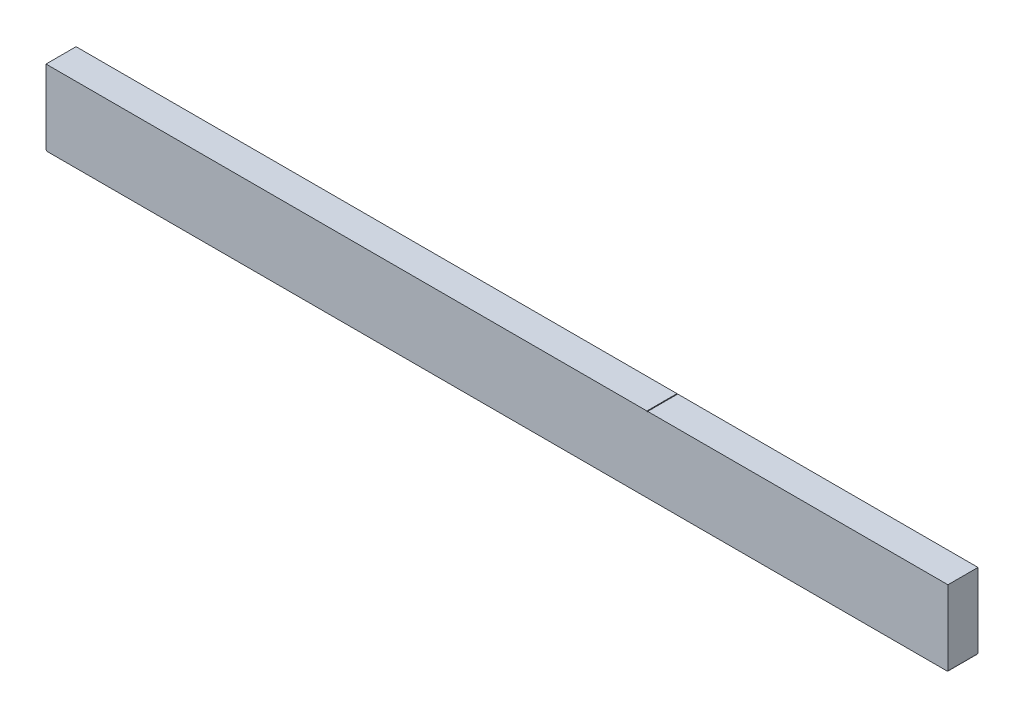
ISO-10303-21;
HEADER;
FILE_DESCRIPTION(('STEP AP214'),'2;1');
FILE_NAME('part.step','',(''),(''),'','','');
FILE_SCHEMA(('AUTOMOTIVE_DESIGN { 1 0 10303 214 1 1 1 1 }'));
ENDSEC;
DATA;
#1=APPLICATION_CONTEXT('core data for automotive mechanical design processes');
#2=APPLICATION_PROTOCOL_DEFINITION('international standard','automotive_design',2000,#1);
#3=PRODUCT_CONTEXT('',#1,'mechanical');
#4=PRODUCT('Part','Part','',(#3));
#5=PRODUCT_RELATED_PRODUCT_CATEGORY('part','',(#4));
#6=PRODUCT_DEFINITION_FORMATION('','',#4);
#7=PRODUCT_DEFINITION_CONTEXT('part definition',#1,'design');
#8=PRODUCT_DEFINITION('design','',#6,#7);
#9=PRODUCT_DEFINITION_SHAPE('','',#8);
#10=(LENGTH_UNIT() NAMED_UNIT(*) SI_UNIT(.MILLI.,.METRE.));
#11=(NAMED_UNIT(*) PLANE_ANGLE_UNIT() SI_UNIT($,.RADIAN.));
#12=(NAMED_UNIT(*) SI_UNIT($,.STERADIAN.) SOLID_ANGLE_UNIT());
#13=UNCERTAINTY_MEASURE_WITH_UNIT(LENGTH_MEASURE(1.E-05),#10,'distance_accuracy_value','');
#14=(GEOMETRIC_REPRESENTATION_CONTEXT(3) GLOBAL_UNCERTAINTY_ASSIGNED_CONTEXT((#13)) GLOBAL_UNIT_ASSIGNED_CONTEXT((#10,
#11,#12)) REPRESENTATION_CONTEXT('',''));
#15=CARTESIAN_POINT('',(0.,0.,0.));
#16=DIRECTION('',(0.,0.,1.));
#17=DIRECTION('',(1.,0.,0.));
#18=AXIS2_PLACEMENT_3D('',#15,#16,#17);
#19=CARTESIAN_POINT('',(6000.,250.,100.));
#20=DIRECTION('',(0.,-1.,0.));
#21=DIRECTION('',(0.,0.,-1.));
#22=AXIS2_PLACEMENT_3D('',#19,#20,#21);
#23=PLANE('',#22);
#24=DIRECTION('',(-1.,0.,0.));
#25=VECTOR('',#24,1.);
#26=CARTESIAN_POINT('',(6000.,250.,-100.));
#27=LINE('',#26,#25);
#28=CARTESIAN_POINT('',(6000.,250.,-100.));
#29=VERTEX_POINT('',#28);
#30=CARTESIAN_POINT('',(4002.5,250.,-100.));
#31=VERTEX_POINT('',#30);
#32=EDGE_CURVE('E244',#29,#31,#27,.T.);
#33=ORIENTED_EDGE('',*,*,#32,.T.);
#34=DIRECTION('',(0.,0.,1.));
#35=VECTOR('',#34,1.);
#36=CARTESIAN_POINT('',(4002.5,250.,100.));
#37=LINE('',#36,#35);
#38=CARTESIAN_POINT('',(4002.5,250.,100.));
#39=VERTEX_POINT('',#38);
#40=EDGE_CURVE('E207',#31,#39,#37,.T.);
#41=ORIENTED_EDGE('',*,*,#40,.T.);
#42=DIRECTION('',(-1.,0.,0.));
#43=VECTOR('',#42,1.);
#44=CARTESIAN_POINT('',(6000.,250.,100.));
#45=LINE('',#44,#43);
#46=CARTESIAN_POINT('',(6000.,250.,100.));
#47=VERTEX_POINT('',#46);
#48=EDGE_CURVE('E239',#47,#39,#45,.T.);
#49=ORIENTED_EDGE('',*,*,#48,.F.);
#50=DIRECTION('',(0.,0.,1.));
#51=VECTOR('',#50,1.);
#52=CARTESIAN_POINT('',(6000.,250.,100.));
#53=LINE('',#52,#51);
#54=EDGE_CURVE('E215',#29,#47,#53,.T.);
#55=ORIENTED_EDGE('',*,*,#54,.F.);
#56=EDGE_LOOP('',(#33,#41,#49,#55));
#57=FACE_BOUND('',#56,.T.);
#58=ADVANCED_FACE('F42',(#57),#23,.F.);
#59=CARTESIAN_POINT('',(6000.,-250.,-100.));
#60=DIRECTION('',(0.,0.,1.));
#61=DIRECTION('',(1.,0.,0.));
#62=AXIS2_PLACEMENT_3D('',#59,#60,#61);
#63=PLANE('',#62);
#64=DIRECTION('',(-1.,0.,0.));
#65=VECTOR('',#64,1.);
#66=CARTESIAN_POINT('',(6000.,-250.,-100.));
#67=LINE('',#66,#65);
#68=CARTESIAN_POINT('',(5997.5,-250.,-100.));
#69=VERTEX_POINT('',#68);
#70=CARTESIAN_POINT('',(2.49999999999998,-250.,-100.));
#71=VERTEX_POINT('',#70);
#72=EDGE_CURVE('E155',#69,#71,#67,.T.);
#73=ORIENTED_EDGE('',*,*,#72,.T.);
#74=DIRECTION('',(0.,1.,0.));
#75=VECTOR('',#74,1.);
#76=CARTESIAN_POINT('',(2.49999999999998,-255.,-100.));
#77=LINE('',#76,#75);
#78=CARTESIAN_POINT('',(2.49999999999998,-245.,-100.));
#79=VERTEX_POINT('',#78);
#80=EDGE_CURVE('E134',#71,#79,#77,.T.);
#81=ORIENTED_EDGE('',*,*,#80,.T.);
#82=DIRECTION('',(-1.,0.,0.));
#83=VECTOR('',#82,1.);
#84=CARTESIAN_POINT('',(-2.50000000000002,-245.,-100.));
#85=LINE('',#84,#83);
#86=CARTESIAN_POINT('',(0.,-245.,-100.));
#87=VERTEX_POINT('',#86);
#88=EDGE_CURVE('E141',#79,#87,#85,.T.);
#89=ORIENTED_EDGE('',*,*,#88,.T.);
#90=DIRECTION('',(0.,1.,0.));
#91=VECTOR('',#90,1.);
#92=CARTESIAN_POINT('',(0.,-250.,-100.));
#93=LINE('',#92,#91);
#94=CARTESIAN_POINT('',(0.,250.,-100.));
#95=VERTEX_POINT('',#94);
#96=EDGE_CURVE('E211',#87,#95,#93,.T.);
#97=ORIENTED_EDGE('',*,*,#96,.T.);
#98=CARTESIAN_POINT('',(3997.5,250.,-100.));
#99=VERTEX_POINT('',#98);
#100=EDGE_CURVE('E243',#99,#95,#27,.T.);
#101=ORIENTED_EDGE('',*,*,#100,.F.);
#102=DIRECTION('',(0.,-1.,0.));
#103=VECTOR('',#102,1.);
#104=CARTESIAN_POINT('',(3997.5,245.,-100.));
#105=LINE('',#104,#103);
#106=CARTESIAN_POINT('',(3997.5,245.,-100.));
#107=VERTEX_POINT('',#106);
#108=EDGE_CURVE('E198',#99,#107,#105,.T.);
#109=ORIENTED_EDGE('',*,*,#108,.T.);
#110=DIRECTION('',(1.,0.,0.));
#111=VECTOR('',#110,1.);
#112=CARTESIAN_POINT('',(3997.5,245.,-100.));
#113=LINE('',#112,#111);
#114=CARTESIAN_POINT('',(4002.5,245.,-100.));
#115=VERTEX_POINT('',#114);
#116=EDGE_CURVE('E184',#107,#115,#113,.T.);
#117=ORIENTED_EDGE('',*,*,#116,.T.);
#118=DIRECTION('',(0.,1.,0.));
#119=VECTOR('',#118,1.);
#120=CARTESIAN_POINT('',(4002.5,245.,-100.));
#121=LINE('',#120,#119);
#122=EDGE_CURVE('E192',#115,#31,#121,.T.);
#123=ORIENTED_EDGE('',*,*,#122,.T.);
#124=ORIENTED_EDGE('',*,*,#32,.F.);
#125=DIRECTION('',(0.,1.,0.));
#126=VECTOR('',#125,1.);
#127=CARTESIAN_POINT('',(6000.,-250.,-100.));
#128=LINE('',#127,#126);
#129=CARTESIAN_POINT('',(6000.,-245.,-100.));
#130=VERTEX_POINT('',#129);
#131=EDGE_CURVE('E212',#130,#29,#128,.T.);
#132=ORIENTED_EDGE('',*,*,#131,.F.);
#133=DIRECTION('',(-1.,0.,0.));
#134=VECTOR('',#133,1.);
#135=CARTESIAN_POINT('',(5997.5,-245.,-100.));
#136=LINE('',#135,#134);
#137=CARTESIAN_POINT('',(5997.5,-245.,-100.));
#138=VERTEX_POINT('',#137);
#139=EDGE_CURVE('E65',#130,#138,#136,.T.);
#140=ORIENTED_EDGE('',*,*,#139,.T.);
#141=DIRECTION('',(0.,-1.,0.));
#142=VECTOR('',#141,1.);
#143=CARTESIAN_POINT('',(5997.5,-255.,-100.));
#144=LINE('',#143,#142);
#145=EDGE_CURVE('E169',#138,#69,#144,.T.);
#146=ORIENTED_EDGE('',*,*,#145,.T.);
#147=EDGE_LOOP('',(#73,#81,#89,#97,#101,#109,#117,#123,#124,#132,#140,#146));
#148=FACE_BOUND('',#147,.T.);
#149=ADVANCED_FACE('F44',(#148),#63,.F.);
#150=CARTESIAN_POINT('',(3997.5,250.,100.));
#151=VERTEX_POINT('',#150);
#152=CARTESIAN_POINT('',(0.,250.,100.));
#153=VERTEX_POINT('',#152);
#154=EDGE_CURVE('E238',#151,#153,#45,.T.);
#155=ORIENTED_EDGE('',*,*,#154,.F.);
#156=DIRECTION('',(0.,0.,-1.));
#157=VECTOR('',#156,1.);
#158=CARTESIAN_POINT('',(3997.5,250.,100.));
#159=LINE('',#158,#157);
#160=EDGE_CURVE('E58',#151,#99,#159,.T.);
#161=ORIENTED_EDGE('',*,*,#160,.T.);
#162=ORIENTED_EDGE('',*,*,#100,.T.);
#163=DIRECTION('',(0.,0.,1.));
#164=VECTOR('',#163,1.);
#165=CARTESIAN_POINT('',(0.,250.,100.));
#166=LINE('',#165,#164);
#167=EDGE_CURVE('E225',#95,#153,#166,.T.);
#168=ORIENTED_EDGE('',*,*,#167,.T.);
#169=EDGE_LOOP('',(#155,#161,#162,#168));
#170=FACE_BOUND('',#169,.T.);
#171=ADVANCED_FACE('F273',(#170),#23,.F.);
#172=CARTESIAN_POINT('',(6000.,-250.,100.));
#173=DIRECTION('',(0.,0.,-1.));
#174=DIRECTION('',(-1.,0.,0.));
#175=AXIS2_PLACEMENT_3D('',#172,#173,#174);
#176=PLANE('',#175);
#177=DIRECTION('',(-1.,0.,0.));
#178=VECTOR('',#177,1.);
#179=CARTESIAN_POINT('',(-2.50000000000002,-245.,100.));
#180=LINE('',#179,#178);
#181=CARTESIAN_POINT('',(2.49999999999998,-245.,100.));
#182=VERTEX_POINT('',#181);
#183=CARTESIAN_POINT('',(0.,-245.,100.));
#184=VERTEX_POINT('',#183);
#185=EDGE_CURVE('E157',#182,#184,#180,.T.);
#186=ORIENTED_EDGE('',*,*,#185,.F.);
#187=DIRECTION('',(0.,1.,0.));
#188=VECTOR('',#187,1.);
#189=CARTESIAN_POINT('',(2.49999999999998,-255.,100.));
#190=LINE('',#189,#188);
#191=CARTESIAN_POINT('',(2.49999999999998,-250.,100.));
#192=VERTEX_POINT('',#191);
#193=EDGE_CURVE('E137',#192,#182,#190,.T.);
#194=ORIENTED_EDGE('',*,*,#193,.F.);
#195=DIRECTION('',(-1.,0.,0.));
#196=VECTOR('',#195,1.);
#197=CARTESIAN_POINT('',(6000.,-250.,100.));
#198=LINE('',#197,#196);
#199=CARTESIAN_POINT('',(5997.5,-250.,100.));
#200=VERTEX_POINT('',#199);
#201=EDGE_CURVE('E234',#200,#192,#198,.T.);
#202=ORIENTED_EDGE('',*,*,#201,.F.);
#203=DIRECTION('',(0.,-1.,0.));
#204=VECTOR('',#203,1.);
#205=CARTESIAN_POINT('',(5997.5,-255.,100.));
#206=LINE('',#205,#204);
#207=CARTESIAN_POINT('',(5997.5,-245.,100.));
#208=VERTEX_POINT('',#207);
#209=EDGE_CURVE('E171',#208,#200,#206,.T.);
#210=ORIENTED_EDGE('',*,*,#209,.F.);
#211=DIRECTION('',(-1.,0.,0.));
#212=VECTOR('',#211,1.);
#213=CARTESIAN_POINT('',(5997.5,-245.,100.));
#214=LINE('',#213,#212);
#215=CARTESIAN_POINT('',(6000.,-245.,100.));
#216=VERTEX_POINT('',#215);
#217=EDGE_CURVE('E163',#216,#208,#214,.T.);
#218=ORIENTED_EDGE('',*,*,#217,.F.);
#219=DIRECTION('',(0.,-1.,0.));
#220=VECTOR('',#219,1.);
#221=CARTESIAN_POINT('',(6000.,-250.,100.));
#222=LINE('',#221,#220);
#223=EDGE_CURVE('E219',#47,#216,#222,.T.);
#224=ORIENTED_EDGE('',*,*,#223,.F.);
#225=ORIENTED_EDGE('',*,*,#48,.T.);
#226=DIRECTION('',(0.,1.,0.));
#227=VECTOR('',#226,1.);
#228=CARTESIAN_POINT('',(4002.5,245.,100.));
#229=LINE('',#228,#227);
#230=CARTESIAN_POINT('',(4002.5,245.,100.));
#231=VERTEX_POINT('',#230);
#232=EDGE_CURVE('E170',#231,#39,#229,.T.);
#233=ORIENTED_EDGE('',*,*,#232,.F.);
#234=DIRECTION('',(1.,0.,0.));
#235=VECTOR('',#234,1.);
#236=CARTESIAN_POINT('',(3997.5,245.,100.));
#237=LINE('',#236,#235);
#238=CARTESIAN_POINT('',(3997.5,245.,100.));
#239=VERTEX_POINT('',#238);
#240=EDGE_CURVE('E188',#239,#231,#237,.T.);
#241=ORIENTED_EDGE('',*,*,#240,.F.);
#242=DIRECTION('',(0.,1.,0.));
#243=VECTOR('',#242,1.);
#244=CARTESIAN_POINT('',(3997.5,-250.,100.));
#245=LINE('',#244,#243);
#246=EDGE_CURVE('E11',#239,#151,#245,.T.);
#247=ORIENTED_EDGE('',*,*,#246,.T.);
#248=ORIENTED_EDGE('',*,*,#154,.T.);
#249=DIRECTION('',(0.,-1.,0.));
#250=VECTOR('',#249,1.);
#251=CARTESIAN_POINT('',(0.,-250.,100.));
#252=LINE('',#251,#250);
#253=EDGE_CURVE('E216',#153,#184,#252,.T.);
#254=ORIENTED_EDGE('',*,*,#253,.T.);
#255=EDGE_LOOP('',(#186,#194,#202,#210,#218,#224,#225,#233,#241,#247,#248,#254));
#256=FACE_BOUND('',#255,.T.);
#257=ADVANCED_FACE('F261',(#256),#176,.F.);
#258=CARTESIAN_POINT('',(6000.,-250.,100.));
#259=DIRECTION('',(0.,1.,0.));
#260=DIRECTION('',(0.,0.,1.));
#261=AXIS2_PLACEMENT_3D('',#258,#259,#260);
#262=PLANE('',#261);
#263=ORIENTED_EDGE('',*,*,#201,.T.);
#264=DIRECTION('',(0.,0.,-1.));
#265=VECTOR('',#264,1.);
#266=CARTESIAN_POINT('',(2.50000000000039,-250.,100.));
#267=LINE('',#266,#265);
#268=EDGE_CURVE('E51',#192,#71,#267,.T.);
#269=ORIENTED_EDGE('',*,*,#268,.T.);
#270=ORIENTED_EDGE('',*,*,#72,.F.);
#271=DIRECTION('',(0.,0.,1.));
#272=VECTOR('',#271,1.);
#273=CARTESIAN_POINT('',(5997.5,-250.,100.));
#274=LINE('',#273,#272);
#275=EDGE_CURVE('E253',#69,#200,#274,.T.);
#276=ORIENTED_EDGE('',*,*,#275,.T.);
#277=EDGE_LOOP('',(#263,#269,#270,#276));
#278=FACE_BOUND('',#277,.T.);
#279=ADVANCED_FACE('F258',(#278),#262,.F.);
#280=CARTESIAN_POINT('',(6000.,0.,0.));
#281=DIRECTION('',(-1.,0.,0.));
#282=DIRECTION('',(0.,0.,1.));
#283=AXIS2_PLACEMENT_3D('',#280,#281,#282);
#284=PLANE('',#283);
#285=ORIENTED_EDGE('',*,*,#223,.T.);
#286=DIRECTION('',(0.,0.,-1.));
#287=VECTOR('',#286,1.);
#288=CARTESIAN_POINT('',(6000.,-245.,0.));
#289=LINE('',#288,#287);
#290=EDGE_CURVE('E250',#216,#130,#289,.T.);
#291=ORIENTED_EDGE('',*,*,#290,.T.);
#292=ORIENTED_EDGE('',*,*,#131,.T.);
#293=ORIENTED_EDGE('',*,*,#54,.T.);
#294=EDGE_LOOP('',(#285,#291,#292,#293));
#295=FACE_BOUND('',#294,.T.);
#296=ADVANCED_FACE('F296',(#295),#284,.F.);
#297=CARTESIAN_POINT('',(0.,0.,0.));
#298=DIRECTION('',(-1.,0.,0.));
#299=DIRECTION('',(0.,0.,1.));
#300=AXIS2_PLACEMENT_3D('',#297,#298,#299);
#301=PLANE('',#300);
#302=DIRECTION('',(0.,0.,-1.));
#303=VECTOR('',#302,1.);
#304=CARTESIAN_POINT('',(0.,-245.,0.));
#305=LINE('',#304,#303);
#306=EDGE_CURVE('E146',#184,#87,#305,.T.);
#307=ORIENTED_EDGE('',*,*,#306,.F.);
#308=ORIENTED_EDGE('',*,*,#253,.F.);
#309=ORIENTED_EDGE('',*,*,#167,.F.);
#310=ORIENTED_EDGE('',*,*,#96,.F.);
#311=EDGE_LOOP('',(#307,#308,#309,#310));
#312=FACE_BOUND('',#311,.T.);
#313=ADVANCED_FACE('F265',(#312),#301,.T.);
#314=CARTESIAN_POINT('',(2.49999999999998,-255.,-100.));
#315=DIRECTION('',(1.,0.,0.));
#316=DIRECTION('',(0.,0.,-1.));
#317=AXIS2_PLACEMENT_3D('',#314,#315,#316);
#318=PLANE('',#317);
#319=ORIENTED_EDGE('',*,*,#193,.T.);
#320=DIRECTION('',(0.,0.,1.));
#321=VECTOR('',#320,1.);
#322=CARTESIAN_POINT('',(2.49999999999998,-245.,-100.));
#323=LINE('',#322,#321);
#324=EDGE_CURVE('E130',#79,#182,#323,.T.);
#325=ORIENTED_EDGE('',*,*,#324,.F.);
#326=ORIENTED_EDGE('',*,*,#80,.F.);
#327=ORIENTED_EDGE('',*,*,#268,.F.);
#328=EDGE_LOOP('',(#319,#325,#326,#327));
#329=FACE_BOUND('',#328,.T.);
#330=ADVANCED_FACE('F132',(#329),#318,.F.);
#331=CARTESIAN_POINT('',(-2.50000000000002,-245.,-100.));
#332=DIRECTION('',(0.,1.,0.));
#333=DIRECTION('',(0.,0.,1.));
#334=AXIS2_PLACEMENT_3D('',#331,#332,#333);
#335=PLANE('',#334);
#336=ORIENTED_EDGE('',*,*,#306,.T.);
#337=ORIENTED_EDGE('',*,*,#88,.F.);
#338=ORIENTED_EDGE('',*,*,#324,.T.);
#339=ORIENTED_EDGE('',*,*,#185,.T.);
#340=EDGE_LOOP('',(#336,#337,#338,#339));
#341=FACE_BOUND('',#340,.T.);
#342=ADVANCED_FACE('F144',(#341),#335,.F.);
#343=CARTESIAN_POINT('',(5997.5,-255.,-100.));
#344=DIRECTION('',(-1.,0.,0.));
#345=DIRECTION('',(0.,0.,1.));
#346=AXIS2_PLACEMENT_3D('',#343,#344,#345);
#347=PLANE('',#346);
#348=ORIENTED_EDGE('',*,*,#145,.F.);
#349=DIRECTION('',(0.,0.,1.));
#350=VECTOR('',#349,1.);
#351=CARTESIAN_POINT('',(5997.5,-245.,-100.));
#352=LINE('',#351,#350);
#353=EDGE_CURVE('E165',#138,#208,#352,.T.);
#354=ORIENTED_EDGE('',*,*,#353,.T.);
#355=ORIENTED_EDGE('',*,*,#209,.T.);
#356=ORIENTED_EDGE('',*,*,#275,.F.);
#357=EDGE_LOOP('',(#348,#354,#355,#356));
#358=FACE_BOUND('',#357,.T.);
#359=ADVANCED_FACE('F300',(#358),#347,.F.);
#360=CARTESIAN_POINT('',(5997.5,-245.,-100.));
#361=DIRECTION('',(0.,1.,0.));
#362=DIRECTION('',(0.,0.,1.));
#363=AXIS2_PLACEMENT_3D('',#360,#361,#362);
#364=PLANE('',#363);
#365=ORIENTED_EDGE('',*,*,#217,.T.);
#366=ORIENTED_EDGE('',*,*,#353,.F.);
#367=ORIENTED_EDGE('',*,*,#139,.F.);
#368=ORIENTED_EDGE('',*,*,#290,.F.);
#369=EDGE_LOOP('',(#365,#366,#367,#368));
#370=FACE_BOUND('',#369,.T.);
#371=ADVANCED_FACE('F297',(#370),#364,.F.);
#372=CARTESIAN_POINT('',(4002.5,245.,-100.));
#373=DIRECTION('',(1.,0.,0.));
#374=DIRECTION('',(0.,0.,-1.));
#375=AXIS2_PLACEMENT_3D('',#372,#373,#374);
#376=PLANE('',#375);
#377=ORIENTED_EDGE('',*,*,#122,.F.);
#378=DIRECTION('',(0.,0.,1.));
#379=VECTOR('',#378,1.);
#380=CARTESIAN_POINT('',(4002.5,245.,-100.));
#381=LINE('',#380,#379);
#382=EDGE_CURVE('E185',#115,#231,#381,.T.);
#383=ORIENTED_EDGE('',*,*,#382,.T.);
#384=ORIENTED_EDGE('',*,*,#232,.T.);
#385=ORIENTED_EDGE('',*,*,#40,.F.);
#386=EDGE_LOOP('',(#377,#383,#384,#385));
#387=FACE_BOUND('',#386,.T.);
#388=ADVANCED_FACE('F291',(#387),#376,.F.);
#389=CARTESIAN_POINT('',(3997.5,245.,-100.));
#390=DIRECTION('',(-1.,0.,0.));
#391=DIRECTION('',(0.,0.,1.));
#392=AXIS2_PLACEMENT_3D('',#389,#390,#391);
#393=PLANE('',#392);
#394=ORIENTED_EDGE('',*,*,#246,.F.);
#395=DIRECTION('',(0.,0.,1.));
#396=VECTOR('',#395,1.);
#397=CARTESIAN_POINT('',(3997.5,245.,-100.));
#398=LINE('',#397,#396);
#399=EDGE_CURVE('E180',#107,#239,#398,.T.);
#400=ORIENTED_EDGE('',*,*,#399,.F.);
#401=ORIENTED_EDGE('',*,*,#108,.F.);
#402=ORIENTED_EDGE('',*,*,#160,.F.);
#403=EDGE_LOOP('',(#394,#400,#401,#402));
#404=FACE_BOUND('',#403,.T.);
#405=ADVANCED_FACE('F313',(#404),#393,.F.);
#406=CARTESIAN_POINT('',(3997.5,245.,-100.));
#407=DIRECTION('',(0.,-1.,0.));
#408=DIRECTION('',(0.,0.,-1.));
#409=AXIS2_PLACEMENT_3D('',#406,#407,#408);
#410=PLANE('',#409);
#411=ORIENTED_EDGE('',*,*,#240,.T.);
#412=ORIENTED_EDGE('',*,*,#382,.F.);
#413=ORIENTED_EDGE('',*,*,#116,.F.);
#414=ORIENTED_EDGE('',*,*,#399,.T.);
#415=EDGE_LOOP('',(#411,#412,#413,#414));
#416=FACE_BOUND('',#415,.T.);
#417=ADVANCED_FACE('F316',(#416),#410,.F.);
#418=CLOSED_SHELL('',(#58,#149,#171,#257,#279,#296,#313,#330,#342,#359,#371,#388,#405,#417));
#419=MANIFOLD_SOLID_BREP('B2',#418);
#420=ADVANCED_BREP_SHAPE_REPRESENTATION('',(#18,#419),#14);
#421=SHAPE_DEFINITION_REPRESENTATION(#9,#420);
ENDSEC;
END-ISO-10303-21;
